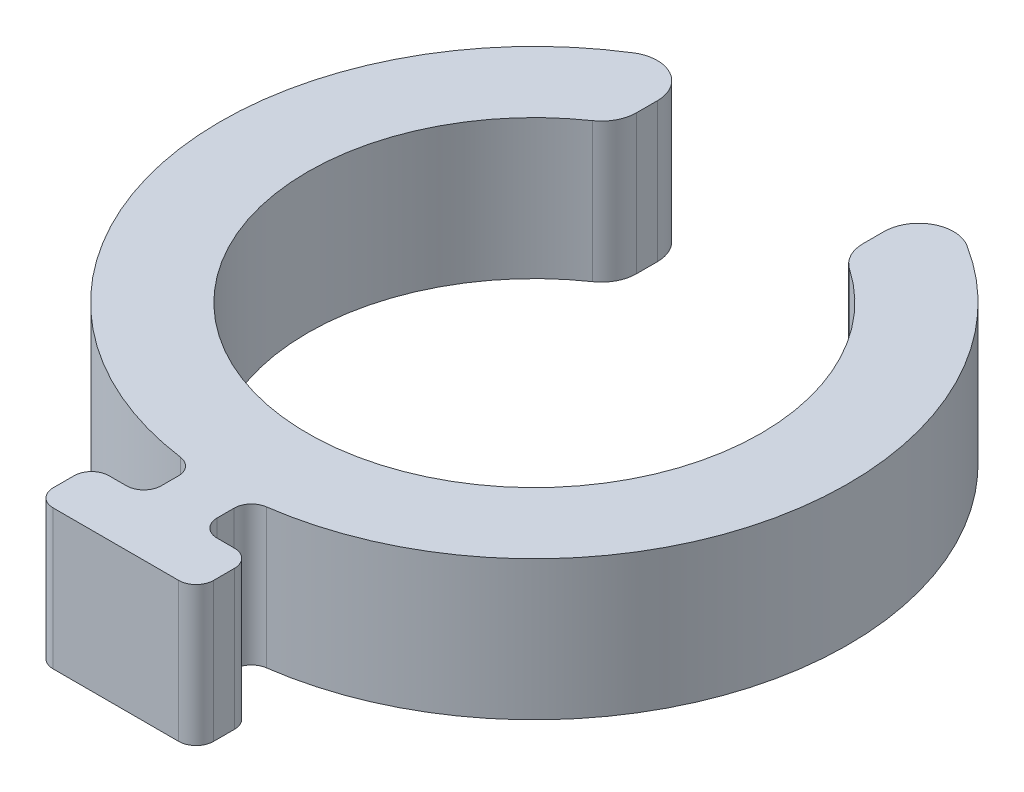
ISO-10303-21;
HEADER;
FILE_DESCRIPTION(('STEP AP214'),'2;1');
FILE_NAME('part.step','',(''),(''),'','','');
FILE_SCHEMA(('AUTOMOTIVE_DESIGN { 1 0 10303 214 1 1 1 1 }'));
ENDSEC;
DATA;
#1=APPLICATION_CONTEXT('core data for automotive mechanical design processes');
#2=APPLICATION_PROTOCOL_DEFINITION('international standard','automotive_design',2000,#1);
#3=PRODUCT_CONTEXT('',#1,'mechanical');
#4=PRODUCT('Part','Part','',(#3));
#5=PRODUCT_RELATED_PRODUCT_CATEGORY('part','',(#4));
#6=PRODUCT_DEFINITION_FORMATION('','',#4);
#7=PRODUCT_DEFINITION_CONTEXT('part definition',#1,'design');
#8=PRODUCT_DEFINITION('design','',#6,#7);
#9=PRODUCT_DEFINITION_SHAPE('','',#8);
#10=(LENGTH_UNIT() NAMED_UNIT(*) SI_UNIT(.MILLI.,.METRE.));
#11=(NAMED_UNIT(*) PLANE_ANGLE_UNIT() SI_UNIT($,.RADIAN.));
#12=(NAMED_UNIT(*) SI_UNIT($,.STERADIAN.) SOLID_ANGLE_UNIT());
#13=UNCERTAINTY_MEASURE_WITH_UNIT(LENGTH_MEASURE(1.E-05),#10,'distance_accuracy_value','');
#14=(GEOMETRIC_REPRESENTATION_CONTEXT(3) GLOBAL_UNCERTAINTY_ASSIGNED_CONTEXT((#13)) GLOBAL_UNIT_ASSIGNED_CONTEXT((#10,
#11,#12)) REPRESENTATION_CONTEXT('',''));
#15=CARTESIAN_POINT('',(0.,0.,0.));
#16=DIRECTION('',(0.,0.,1.));
#17=DIRECTION('',(1.,0.,0.));
#18=AXIS2_PLACEMENT_3D('',#15,#16,#17);
#19=CARTESIAN_POINT('',(0.,4.,0.));
#20=DIRECTION('',(0.,-1.,0.));
#21=DIRECTION('',(0.,0.,-1.));
#22=AXIS2_PLACEMENT_3D('',#19,#20,#21);
#23=CYLINDRICAL_SURFACE('',#22,9.);
#24=CARTESIAN_POINT('',(0.,0.,0.));
#25=DIRECTION('',(0.,1.,0.));
#26=DIRECTION('',(0.,0.,1.));
#27=AXIS2_PLACEMENT_3D('',#24,#25,#26);
#28=CIRCLE('',#27,9.);
#29=CARTESIAN_POINT('',(-4.78125,0.,-7.62493596284585));
#30=VERTEX_POINT('',#29);
#31=CARTESIAN_POINT('',(-1.23157894736842,0.,8.91533584877198));
#32=VERTEX_POINT('',#31);
#33=EDGE_CURVE('E326',#30,#32,#28,.T.);
#34=ORIENTED_EDGE('',*,*,#33,.T.);
#35=DIRECTION('',(0.,-1.,0.));
#36=VECTOR('',#35,1.);
#37=CARTESIAN_POINT('',(-1.23157894736842,4.,8.91533584877199));
#38=LINE('',#37,#36);
#39=CARTESIAN_POINT('',(-1.23157894736842,4.,8.91533584877198));
#40=VERTEX_POINT('',#39);
#41=EDGE_CURVE('E288',#32,#40,#38,.F.);
#42=ORIENTED_EDGE('',*,*,#41,.T.);
#43=CARTESIAN_POINT('',(0.,4.,0.));
#44=DIRECTION('',(0.,1.,0.));
#45=DIRECTION('',(0.,0.,1.));
#46=AXIS2_PLACEMENT_3D('',#43,#44,#45);
#47=CIRCLE('',#46,9.);
#48=CARTESIAN_POINT('',(-4.78125,4.,-7.62493596284585));
#49=VERTEX_POINT('',#48);
#50=EDGE_CURVE('E205',#49,#40,#47,.T.);
#51=ORIENTED_EDGE('',*,*,#50,.F.);
#52=DIRECTION('',(0.,-1.,0.));
#53=VECTOR('',#52,1.);
#54=CARTESIAN_POINT('',(-4.78125,4.,-7.62493596284585));
#55=LINE('',#54,#53);
#56=EDGE_CURVE('E230',#49,#30,#55,.T.);
#57=ORIENTED_EDGE('',*,*,#56,.T.);
#58=EDGE_LOOP('',(#34,#42,#51,#57));
#59=FACE_BOUND('',#58,.T.);
#60=ADVANCED_FACE('F16',(#59),#23,.T.);
#61=CARTESIAN_POINT('',(1.23157894736842,4.,8.91533584877198));
#62=VERTEX_POINT('',#61);
#63=CARTESIAN_POINT('',(4.78125,4.,-7.62493596284585));
#64=VERTEX_POINT('',#63);
#65=EDGE_CURVE('E202',#62,#64,#47,.T.);
#66=ORIENTED_EDGE('',*,*,#65,.F.);
#67=DIRECTION('',(0.,-1.,0.));
#68=VECTOR('',#67,1.);
#69=CARTESIAN_POINT('',(1.23157894736842,4.,8.91533584877199));
#70=LINE('',#69,#68);
#71=CARTESIAN_POINT('',(1.23157894736842,0.,8.91533584877198));
#72=VERTEX_POINT('',#71);
#73=EDGE_CURVE('E290',#62,#72,#70,.T.);
#74=ORIENTED_EDGE('',*,*,#73,.T.);
#75=CARTESIAN_POINT('',(4.78125,0.,-7.62493596284585));
#76=VERTEX_POINT('',#75);
#77=EDGE_CURVE('E208',#72,#76,#28,.T.);
#78=ORIENTED_EDGE('',*,*,#77,.T.);
#79=DIRECTION('',(0.,-1.,0.));
#80=VECTOR('',#79,1.);
#81=CARTESIAN_POINT('',(4.78125,4.,-7.62493596284585));
#82=LINE('',#81,#80);
#83=EDGE_CURVE('E227',#76,#64,#82,.F.);
#84=ORIENTED_EDGE('',*,*,#83,.T.);
#85=EDGE_LOOP('',(#66,#74,#78,#84));
#86=FACE_BOUND('',#85,.T.);
#87=ADVANCED_FACE('F420',(#86),#23,.T.);
#88=CARTESIAN_POINT('',(0.,4.,0.));
#89=DIRECTION('',(0.,1.,0.));
#90=DIRECTION('',(0.,0.,1.));
#91=AXIS2_PLACEMENT_3D('',#88,#89,#90);
#92=PLANE('',#91);
#93=DIRECTION('',(-1.,0.,0.));
#94=VECTOR('',#93,1.);
#95=CARTESIAN_POINT('',(-2.3,4.,10.4));
#96=LINE('',#95,#94);
#97=CARTESIAN_POINT('',(-1.3,4.,10.4));
#98=VERTEX_POINT('',#97);
#99=CARTESIAN_POINT('',(-1.8,4.,10.4));
#100=VERTEX_POINT('',#99);
#101=EDGE_CURVE('E320',#98,#100,#96,.T.);
#102=ORIENTED_EDGE('',*,*,#101,.T.);
#103=CARTESIAN_POINT('',(-1.8,4.,10.9));
#104=DIRECTION('',(0.,1.,0.));
#105=DIRECTION('',(0.,0.,1.));
#106=AXIS2_PLACEMENT_3D('',#103,#104,#105);
#107=CIRCLE('',#106,0.5);
#108=CARTESIAN_POINT('',(-2.3,4.,10.9));
#109=VERTEX_POINT('',#108);
#110=EDGE_CURVE('E261',#100,#109,#107,.T.);
#111=ORIENTED_EDGE('',*,*,#110,.T.);
#112=DIRECTION('',(0.,0.,1.));
#113=VECTOR('',#112,1.);
#114=CARTESIAN_POINT('',(-2.3,4.,12.));
#115=LINE('',#114,#113);
#116=CARTESIAN_POINT('',(-2.3,4.,11.5));
#117=VERTEX_POINT('',#116);
#118=EDGE_CURVE('E343',#109,#117,#115,.T.);
#119=ORIENTED_EDGE('',*,*,#118,.T.);
#120=CARTESIAN_POINT('',(-1.8,4.,11.5));
#121=DIRECTION('',(0.,1.,0.));
#122=DIRECTION('',(0.,0.,1.));
#123=AXIS2_PLACEMENT_3D('',#120,#121,#122);
#124=CIRCLE('',#123,0.5);
#125=CARTESIAN_POINT('',(-1.8,4.,12.));
#126=VERTEX_POINT('',#125);
#127=EDGE_CURVE('E259',#117,#126,#124,.T.);
#128=ORIENTED_EDGE('',*,*,#127,.T.);
#129=DIRECTION('',(1.,0.,0.));
#130=VECTOR('',#129,1.);
#131=CARTESIAN_POINT('',(-2.3,4.,12.));
#132=LINE('',#131,#130);
#133=CARTESIAN_POINT('',(1.8,4.,12.));
#134=VERTEX_POINT('',#133);
#135=EDGE_CURVE('E336',#126,#134,#132,.T.);
#136=ORIENTED_EDGE('',*,*,#135,.T.);
#137=CARTESIAN_POINT('',(1.8,4.,11.5));
#138=DIRECTION('',(0.,1.,0.));
#139=DIRECTION('',(0.,0.,1.));
#140=AXIS2_PLACEMENT_3D('',#137,#138,#139);
#141=CIRCLE('',#140,0.5);
#142=CARTESIAN_POINT('',(2.3,4.,11.5));
#143=VERTEX_POINT('',#142);
#144=EDGE_CURVE('E255',#134,#143,#141,.T.);
#145=ORIENTED_EDGE('',*,*,#144,.T.);
#146=DIRECTION('',(0.,0.,-1.));
#147=VECTOR('',#146,1.);
#148=CARTESIAN_POINT('',(2.3,4.,12.));
#149=LINE('',#148,#147);
#150=CARTESIAN_POINT('',(2.3,4.,10.9));
#151=VERTEX_POINT('',#150);
#152=EDGE_CURVE('E331',#143,#151,#149,.T.);
#153=ORIENTED_EDGE('',*,*,#152,.T.);
#154=CARTESIAN_POINT('',(1.8,4.,10.9));
#155=DIRECTION('',(0.,1.,0.));
#156=DIRECTION('',(0.,0.,1.));
#157=AXIS2_PLACEMENT_3D('',#154,#155,#156);
#158=CIRCLE('',#157,0.5);
#159=CARTESIAN_POINT('',(1.8,4.,10.4));
#160=VERTEX_POINT('',#159);
#161=EDGE_CURVE('E257',#151,#160,#158,.T.);
#162=ORIENTED_EDGE('',*,*,#161,.T.);
#163=DIRECTION('',(-1.,0.,0.));
#164=VECTOR('',#163,1.);
#165=CARTESIAN_POINT('',(0.8,4.,10.4));
#166=LINE('',#165,#164);
#167=CARTESIAN_POINT('',(1.3,4.,10.4));
#168=VERTEX_POINT('',#167);
#169=EDGE_CURVE('E329',#160,#168,#166,.T.);
#170=ORIENTED_EDGE('',*,*,#169,.T.);
#171=CARTESIAN_POINT('',(1.3,4.,9.9));
#172=DIRECTION('',(0.,1.,0.));
#173=DIRECTION('',(0.,0.,1.));
#174=AXIS2_PLACEMENT_3D('',#171,#172,#173);
#175=CIRCLE('',#174,0.5);
#176=CARTESIAN_POINT('',(0.8,4.,9.9));
#177=VERTEX_POINT('',#176);
#178=EDGE_CURVE('E294',#168,#177,#175,.F.);
#179=ORIENTED_EDGE('',*,*,#178,.T.);
#180=DIRECTION('',(0.,0.,-1.));
#181=VECTOR('',#180,1.);
#182=CARTESIAN_POINT('',(0.8,4.,10.4));
#183=LINE('',#182,#181);
#184=CARTESIAN_POINT('',(0.8,4.,9.41063228481487));
#185=VERTEX_POINT('',#184);
#186=EDGE_CURVE('E321',#177,#185,#183,.T.);
#187=ORIENTED_EDGE('',*,*,#186,.T.);
#188=CARTESIAN_POINT('',(1.3,4.,9.41063228481487));
#189=DIRECTION('',(0.,1.,0.));
#190=DIRECTION('',(0.,0.,1.));
#191=AXIS2_PLACEMENT_3D('',#188,#189,#190);
#192=CIRCLE('',#191,0.5);
#193=EDGE_CURVE('E24',#185,#62,#192,.F.);
#194=ORIENTED_EDGE('',*,*,#193,.T.);
#195=ORIENTED_EDGE('',*,*,#65,.T.);
#196=CARTESIAN_POINT('',(4.25,4.,-6.77772085586298));
#197=DIRECTION('',(0.,1.,0.));
#198=DIRECTION('',(0.,0.,1.));
#199=AXIS2_PLACEMENT_3D('',#196,#197,#198);
#200=CIRCLE('',#199,1.);
#201=CARTESIAN_POINT('',(3.25,4.,-6.77772085586298));
#202=VERTEX_POINT('',#201);
#203=EDGE_CURVE('E223',#64,#202,#200,.T.);
#204=ORIENTED_EDGE('',*,*,#203,.T.);
#205=DIRECTION('',(0.,0.,-1.));
#206=VECTOR('',#205,1.);
#207=CARTESIAN_POINT('',(3.25,4.,0.));
#208=LINE('',#207,#206);
#209=CARTESIAN_POINT('',(3.25,4.,-6.17960354715414));
#210=VERTEX_POINT('',#209);
#211=EDGE_CURVE('E432',#210,#202,#208,.T.);
#212=ORIENTED_EDGE('',*,*,#211,.F.);
#213=CARTESIAN_POINT('',(4.25,4.,-6.17960354715414));
#214=DIRECTION('',(0.,1.,0.));
#215=DIRECTION('',(0.,0.,1.));
#216=AXIS2_PLACEMENT_3D('',#213,#214,#215);
#217=CIRCLE('',#216,1.);
#218=CARTESIAN_POINT('',(3.68333333333333,4.,-5.35565640753359));
#219=VERTEX_POINT('',#218);
#220=EDGE_CURVE('E225',#210,#219,#217,.T.);
#221=ORIENTED_EDGE('',*,*,#220,.T.);
#222=CARTESIAN_POINT('',(0.,4.,0.));
#223=DIRECTION('',(0.,1.,0.));
#224=DIRECTION('',(0.,0.,1.));
#225=AXIS2_PLACEMENT_3D('',#222,#223,#224);
#226=CIRCLE('',#225,6.5);
#227=CARTESIAN_POINT('',(-3.68333333333333,4.,-5.35565640753359));
#228=VERTEX_POINT('',#227);
#229=EDGE_CURVE('E198',#228,#219,#226,.T.);
#230=ORIENTED_EDGE('',*,*,#229,.F.);
#231=CARTESIAN_POINT('',(-4.25,4.,-6.17960354715414));
#232=DIRECTION('',(0.,1.,0.));
#233=DIRECTION('',(0.,0.,1.));
#234=AXIS2_PLACEMENT_3D('',#231,#232,#233);
#235=CIRCLE('',#234,1.);
#236=CARTESIAN_POINT('',(-3.25,4.,-6.17960354715414));
#237=VERTEX_POINT('',#236);
#238=EDGE_CURVE('E201',#228,#237,#235,.T.);
#239=ORIENTED_EDGE('',*,*,#238,.T.);
#240=DIRECTION('',(0.,0.,1.));
#241=VECTOR('',#240,1.);
#242=CARTESIAN_POINT('',(-3.25,4.,0.));
#243=LINE('',#242,#241);
#244=CARTESIAN_POINT('',(-3.25,4.,-6.77772085586298));
#245=VERTEX_POINT('',#244);
#246=EDGE_CURVE('E436',#245,#237,#243,.T.);
#247=ORIENTED_EDGE('',*,*,#246,.F.);
#248=CARTESIAN_POINT('',(-4.25,4.,-6.77772085586298));
#249=DIRECTION('',(0.,1.,0.));
#250=DIRECTION('',(0.,0.,1.));
#251=AXIS2_PLACEMENT_3D('',#248,#249,#250);
#252=CIRCLE('',#251,1.);
#253=EDGE_CURVE('E221',#245,#49,#252,.T.);
#254=ORIENTED_EDGE('',*,*,#253,.T.);
#255=ORIENTED_EDGE('',*,*,#50,.T.);
#256=CARTESIAN_POINT('',(-1.3,4.,9.41063228481487));
#257=DIRECTION('',(0.,1.,0.));
#258=DIRECTION('',(0.,0.,1.));
#259=AXIS2_PLACEMENT_3D('',#256,#257,#258);
#260=CIRCLE('',#259,0.5);
#261=CARTESIAN_POINT('',(-0.8,4.,9.41063228481487));
#262=VERTEX_POINT('',#261);
#263=EDGE_CURVE('E302',#40,#262,#260,.F.);
#264=ORIENTED_EDGE('',*,*,#263,.T.);
#265=DIRECTION('',(0.,0.,1.));
#266=VECTOR('',#265,1.);
#267=CARTESIAN_POINT('',(-0.8,4.,10.4));
#268=LINE('',#267,#266);
#269=CARTESIAN_POINT('',(-0.8,4.,9.9));
#270=VERTEX_POINT('',#269);
#271=EDGE_CURVE('E309',#262,#270,#268,.T.);
#272=ORIENTED_EDGE('',*,*,#271,.T.);
#273=CARTESIAN_POINT('',(-1.3,4.,9.9));
#274=DIRECTION('',(0.,1.,0.));
#275=DIRECTION('',(0.,0.,1.));
#276=AXIS2_PLACEMENT_3D('',#273,#274,#275);
#277=CIRCLE('',#276,0.5);
#278=EDGE_CURVE('E298',#270,#98,#277,.F.);
#279=ORIENTED_EDGE('',*,*,#278,.T.);
#280=EDGE_LOOP('',(#102,#111,#119,#128,#136,#145,#153,#162,#170,#179,#187,#194,#195,#204,#212,
#221,#230,#239,#247,#254,#255,#264,#272,#279));
#281=FACE_BOUND('',#280,.T.);
#282=ADVANCED_FACE('F308',(#281),#92,.T.);
#283=CARTESIAN_POINT('',(0.,0.,0.));
#284=DIRECTION('',(0.,1.,0.));
#285=DIRECTION('',(0.,0.,1.));
#286=AXIS2_PLACEMENT_3D('',#283,#284,#285);
#287=PLANE('',#286);
#288=DIRECTION('',(0.,0.,1.));
#289=VECTOR('',#288,1.);
#290=CARTESIAN_POINT('',(-2.3,0.,12.));
#291=LINE('',#290,#289);
#292=CARTESIAN_POINT('',(-2.3,0.,10.9));
#293=VERTEX_POINT('',#292);
#294=CARTESIAN_POINT('',(-2.3,0.,11.5));
#295=VERTEX_POINT('',#294);
#296=EDGE_CURVE('E364',#293,#295,#291,.T.);
#297=ORIENTED_EDGE('',*,*,#296,.F.);
#298=CARTESIAN_POINT('',(-1.8,0.,10.9));
#299=DIRECTION('',(0.,1.,0.));
#300=DIRECTION('',(0.,0.,1.));
#301=AXIS2_PLACEMENT_3D('',#298,#299,#300);
#302=CIRCLE('',#301,0.5);
#303=CARTESIAN_POINT('',(-1.8,0.,10.4));
#304=VERTEX_POINT('',#303);
#305=EDGE_CURVE('E248',#293,#304,#302,.F.);
#306=ORIENTED_EDGE('',*,*,#305,.T.);
#307=DIRECTION('',(-1.,0.,0.));
#308=VECTOR('',#307,1.);
#309=CARTESIAN_POINT('',(-2.3,0.,10.4));
#310=LINE('',#309,#308);
#311=CARTESIAN_POINT('',(-1.3,0.,10.4));
#312=VERTEX_POINT('',#311);
#313=EDGE_CURVE('E366',#312,#304,#310,.T.);
#314=ORIENTED_EDGE('',*,*,#313,.F.);
#315=CARTESIAN_POINT('',(-1.3,0.,9.9));
#316=DIRECTION('',(0.,1.,0.));
#317=DIRECTION('',(0.,0.,1.));
#318=AXIS2_PLACEMENT_3D('',#315,#316,#317);
#319=CIRCLE('',#318,0.5);
#320=CARTESIAN_POINT('',(-0.8,0.,9.9));
#321=VERTEX_POINT('',#320);
#322=EDGE_CURVE('E296',#312,#321,#319,.T.);
#323=ORIENTED_EDGE('',*,*,#322,.T.);
#324=DIRECTION('',(0.,0.,1.));
#325=VECTOR('',#324,1.);
#326=CARTESIAN_POINT('',(-0.8,0.,10.4));
#327=LINE('',#326,#325);
#328=CARTESIAN_POINT('',(-0.8,0.,9.41063228481487));
#329=VERTEX_POINT('',#328);
#330=EDGE_CURVE('E197',#329,#321,#327,.T.);
#331=ORIENTED_EDGE('',*,*,#330,.F.);
#332=CARTESIAN_POINT('',(-1.3,0.,9.41063228481487));
#333=DIRECTION('',(0.,1.,0.));
#334=DIRECTION('',(0.,0.,1.));
#335=AXIS2_PLACEMENT_3D('',#332,#333,#334);
#336=CIRCLE('',#335,0.5);
#337=EDGE_CURVE('E300',#329,#32,#336,.T.);
#338=ORIENTED_EDGE('',*,*,#337,.T.);
#339=ORIENTED_EDGE('',*,*,#33,.F.);
#340=CARTESIAN_POINT('',(-4.25,0.,-6.77772085586298));
#341=DIRECTION('',(0.,1.,0.));
#342=DIRECTION('',(0.,0.,1.));
#343=AXIS2_PLACEMENT_3D('',#340,#341,#342);
#344=CIRCLE('',#343,1.);
#345=CARTESIAN_POINT('',(-3.25,0.,-6.77772085586298));
#346=VERTEX_POINT('',#345);
#347=EDGE_CURVE('E186',#30,#346,#344,.F.);
#348=ORIENTED_EDGE('',*,*,#347,.T.);
#349=DIRECTION('',(0.,0.,1.));
#350=VECTOR('',#349,1.);
#351=CARTESIAN_POINT('',(-3.25,0.,0.));
#352=LINE('',#351,#350);
#353=CARTESIAN_POINT('',(-3.25,0.,-6.17960354715414));
#354=VERTEX_POINT('',#353);
#355=EDGE_CURVE('E182',#346,#354,#352,.T.);
#356=ORIENTED_EDGE('',*,*,#355,.T.);
#357=CARTESIAN_POINT('',(-4.25,0.,-6.17960354715414));
#358=DIRECTION('',(0.,1.,0.));
#359=DIRECTION('',(0.,0.,1.));
#360=AXIS2_PLACEMENT_3D('',#357,#358,#359);
#361=CIRCLE('',#360,1.);
#362=CARTESIAN_POINT('',(-3.68333333333333,0.,-5.35565640753359));
#363=VERTEX_POINT('',#362);
#364=EDGE_CURVE('E176',#354,#363,#361,.F.);
#365=ORIENTED_EDGE('',*,*,#364,.T.);
#366=CARTESIAN_POINT('',(0.,0.,0.));
#367=DIRECTION('',(0.,1.,0.));
#368=DIRECTION('',(0.,0.,1.));
#369=AXIS2_PLACEMENT_3D('',#366,#367,#368);
#370=CIRCLE('',#369,6.5);
#371=CARTESIAN_POINT('',(3.68333333333333,0.,-5.35565640753359));
#372=VERTEX_POINT('',#371);
#373=EDGE_CURVE('E180',#363,#372,#370,.T.);
#374=ORIENTED_EDGE('',*,*,#373,.T.);
#375=CARTESIAN_POINT('',(4.25,0.,-6.17960354715414));
#376=DIRECTION('',(0.,1.,0.));
#377=DIRECTION('',(0.,0.,1.));
#378=AXIS2_PLACEMENT_3D('',#375,#376,#377);
#379=CIRCLE('',#378,1.);
#380=CARTESIAN_POINT('',(3.25,0.,-6.17960354715414));
#381=VERTEX_POINT('',#380);
#382=EDGE_CURVE('E214',#372,#381,#379,.F.);
#383=ORIENTED_EDGE('',*,*,#382,.T.);
#384=DIRECTION('',(0.,0.,-1.));
#385=VECTOR('',#384,1.);
#386=CARTESIAN_POINT('',(3.25,0.,0.));
#387=LINE('',#386,#385);
#388=CARTESIAN_POINT('',(3.25,0.,-6.77772085586298));
#389=VERTEX_POINT('',#388);
#390=EDGE_CURVE('E430',#381,#389,#387,.T.);
#391=ORIENTED_EDGE('',*,*,#390,.T.);
#392=CARTESIAN_POINT('',(4.25,0.,-6.77772085586298));
#393=DIRECTION('',(0.,1.,0.));
#394=DIRECTION('',(0.,0.,1.));
#395=AXIS2_PLACEMENT_3D('',#392,#393,#394);
#396=CIRCLE('',#395,1.);
#397=EDGE_CURVE('E211',#389,#76,#396,.F.);
#398=ORIENTED_EDGE('',*,*,#397,.T.);
#399=ORIENTED_EDGE('',*,*,#77,.F.);
#400=CARTESIAN_POINT('',(1.3,0.,9.41063228481487));
#401=DIRECTION('',(0.,1.,0.));
#402=DIRECTION('',(0.,0.,1.));
#403=AXIS2_PLACEMENT_3D('',#400,#401,#402);
#404=CIRCLE('',#403,0.5);
#405=CARTESIAN_POINT('',(0.8,0.,9.41063228481487));
#406=VERTEX_POINT('',#405);
#407=EDGE_CURVE('E11',#72,#406,#404,.T.);
#408=ORIENTED_EDGE('',*,*,#407,.T.);
#409=DIRECTION('',(0.,0.,-1.));
#410=VECTOR('',#409,1.);
#411=CARTESIAN_POINT('',(0.8,0.,10.4));
#412=LINE('',#411,#410);
#413=CARTESIAN_POINT('',(0.8,0.,9.9));
#414=VERTEX_POINT('',#413);
#415=EDGE_CURVE('E347',#414,#406,#412,.T.);
#416=ORIENTED_EDGE('',*,*,#415,.F.);
#417=CARTESIAN_POINT('',(1.3,0.,9.9));
#418=DIRECTION('',(0.,1.,0.));
#419=DIRECTION('',(0.,0.,1.));
#420=AXIS2_PLACEMENT_3D('',#417,#418,#419);
#421=CIRCLE('',#420,0.5);
#422=CARTESIAN_POINT('',(1.3,0.,10.4));
#423=VERTEX_POINT('',#422);
#424=EDGE_CURVE('E292',#414,#423,#421,.T.);
#425=ORIENTED_EDGE('',*,*,#424,.T.);
#426=DIRECTION('',(-1.,0.,0.));
#427=VECTOR('',#426,1.);
#428=CARTESIAN_POINT('',(0.8,0.,10.4));
#429=LINE('',#428,#427);
#430=CARTESIAN_POINT('',(1.8,0.,10.4));
#431=VERTEX_POINT('',#430);
#432=EDGE_CURVE('E350',#431,#423,#429,.T.);
#433=ORIENTED_EDGE('',*,*,#432,.F.);
#434=CARTESIAN_POINT('',(1.8,0.,10.9));
#435=DIRECTION('',(0.,1.,0.));
#436=DIRECTION('',(0.,0.,1.));
#437=AXIS2_PLACEMENT_3D('',#434,#435,#436);
#438=CIRCLE('',#437,0.5);
#439=CARTESIAN_POINT('',(2.3,0.,10.9));
#440=VERTEX_POINT('',#439);
#441=EDGE_CURVE('E244',#431,#440,#438,.F.);
#442=ORIENTED_EDGE('',*,*,#441,.T.);
#443=DIRECTION('',(0.,0.,-1.));
#444=VECTOR('',#443,1.);
#445=CARTESIAN_POINT('',(2.3,0.,12.));
#446=LINE('',#445,#444);
#447=CARTESIAN_POINT('',(2.3,0.,11.5));
#448=VERTEX_POINT('',#447);
#449=EDGE_CURVE('E355',#448,#440,#446,.T.);
#450=ORIENTED_EDGE('',*,*,#449,.F.);
#451=CARTESIAN_POINT('',(1.8,0.,11.5));
#452=DIRECTION('',(0.,1.,0.));
#453=DIRECTION('',(0.,0.,1.));
#454=AXIS2_PLACEMENT_3D('',#451,#452,#453);
#455=CIRCLE('',#454,0.5);
#456=CARTESIAN_POINT('',(1.8,0.,12.));
#457=VERTEX_POINT('',#456);
#458=EDGE_CURVE('E242',#448,#457,#455,.F.);
#459=ORIENTED_EDGE('',*,*,#458,.T.);
#460=DIRECTION('',(1.,0.,0.));
#461=VECTOR('',#460,1.);
#462=CARTESIAN_POINT('',(-2.3,0.,12.));
#463=LINE('',#462,#461);
#464=CARTESIAN_POINT('',(-1.8,0.,12.));
#465=VERTEX_POINT('',#464);
#466=EDGE_CURVE('E361',#465,#457,#463,.T.);
#467=ORIENTED_EDGE('',*,*,#466,.F.);
#468=CARTESIAN_POINT('',(-1.8,0.,11.5));
#469=DIRECTION('',(0.,1.,0.));
#470=DIRECTION('',(0.,0.,1.));
#471=AXIS2_PLACEMENT_3D('',#468,#469,#470);
#472=CIRCLE('',#471,0.5);
#473=EDGE_CURVE('E246',#465,#295,#472,.F.);
#474=ORIENTED_EDGE('',*,*,#473,.T.);
#475=EDGE_LOOP('',(#297,#306,#314,#323,#331,#338,#339,#348,#356,#365,#374,#383,#391,#398,#399,
#408,#416,#425,#433,#442,#450,#459,#467,#474));
#476=FACE_BOUND('',#475,.T.);
#477=ADVANCED_FACE('F179',(#476),#287,.F.);
#478=CARTESIAN_POINT('',(-0.8,16.8514590611339,10.4));
#479=DIRECTION('',(1.,0.,0.));
#480=DIRECTION('',(0.,0.,-1.));
#481=AXIS2_PLACEMENT_3D('',#478,#479,#480);
#482=PLANE('',#481);
#483=ORIENTED_EDGE('',*,*,#330,.T.);
#484=DIRECTION('',(0.,-1.,0.));
#485=VECTOR('',#484,1.);
#486=CARTESIAN_POINT('',(-0.8,4.,9.9));
#487=LINE('',#486,#485);
#488=EDGE_CURVE('E286',#321,#270,#487,.F.);
#489=ORIENTED_EDGE('',*,*,#488,.T.);
#490=ORIENTED_EDGE('',*,*,#271,.F.);
#491=DIRECTION('',(0.,1.,0.));
#492=VECTOR('',#491,1.);
#493=CARTESIAN_POINT('',(-0.8,0.,9.41063228481487));
#494=LINE('',#493,#492);
#495=EDGE_CURVE('E283',#262,#329,#494,.F.);
#496=ORIENTED_EDGE('',*,*,#495,.T.);
#497=EDGE_LOOP('',(#483,#489,#490,#496));
#498=FACE_BOUND('',#497,.T.);
#499=ADVANCED_FACE('F317',(#498),#482,.F.);
#500=CARTESIAN_POINT('',(0.8,16.8514590611339,10.4));
#501=DIRECTION('',(-1.,0.,0.));
#502=DIRECTION('',(0.,0.,1.));
#503=AXIS2_PLACEMENT_3D('',#500,#501,#502);
#504=PLANE('',#503);
#505=ORIENTED_EDGE('',*,*,#186,.F.);
#506=DIRECTION('',(0.,-1.,0.));
#507=VECTOR('',#506,1.);
#508=CARTESIAN_POINT('',(0.8,0.,9.9));
#509=LINE('',#508,#507);
#510=EDGE_CURVE('E280',#177,#414,#509,.T.);
#511=ORIENTED_EDGE('',*,*,#510,.T.);
#512=ORIENTED_EDGE('',*,*,#415,.T.);
#513=DIRECTION('',(0.,1.,0.));
#514=VECTOR('',#513,1.);
#515=CARTESIAN_POINT('',(0.8,4.,9.41063228481487));
#516=LINE('',#515,#514);
#517=EDGE_CURVE('E278',#406,#185,#516,.T.);
#518=ORIENTED_EDGE('',*,*,#517,.T.);
#519=EDGE_LOOP('',(#505,#511,#512,#518));
#520=FACE_BOUND('',#519,.T.);
#521=ADVANCED_FACE('F413',(#520),#504,.F.);
#522=CARTESIAN_POINT('',(-2.3,16.8514590611339,10.4));
#523=DIRECTION('',(0.,0.,1.));
#524=DIRECTION('',(1.,0.,0.));
#525=AXIS2_PLACEMENT_3D('',#522,#523,#524);
#526=PLANE('',#525);
#527=ORIENTED_EDGE('',*,*,#313,.T.);
#528=DIRECTION('',(0.,-1.,0.));
#529=VECTOR('',#528,1.);
#530=CARTESIAN_POINT('',(-1.8,16.8514590611339,10.4));
#531=LINE('',#530,#529);
#532=EDGE_CURVE('E253',#304,#100,#531,.F.);
#533=ORIENTED_EDGE('',*,*,#532,.T.);
#534=ORIENTED_EDGE('',*,*,#101,.F.);
#535=DIRECTION('',(0.,-1.,0.));
#536=VECTOR('',#535,1.);
#537=CARTESIAN_POINT('',(-1.3,0.,10.4));
#538=LINE('',#537,#536);
#539=EDGE_CURVE('E250',#98,#312,#538,.T.);
#540=ORIENTED_EDGE('',*,*,#539,.T.);
#541=EDGE_LOOP('',(#527,#533,#534,#540));
#542=FACE_BOUND('',#541,.T.);
#543=ADVANCED_FACE('F376',(#542),#526,.F.);
#544=CARTESIAN_POINT('',(-2.3,16.8514590611339,12.));
#545=DIRECTION('',(1.,0.,0.));
#546=DIRECTION('',(0.,0.,-1.));
#547=AXIS2_PLACEMENT_3D('',#544,#545,#546);
#548=PLANE('',#547);
#549=ORIENTED_EDGE('',*,*,#118,.F.);
#550=DIRECTION('',(0.,-1.,0.));
#551=VECTOR('',#550,1.);
#552=CARTESIAN_POINT('',(-2.3,16.8514590611339,10.9));
#553=LINE('',#552,#551);
#554=EDGE_CURVE('E239',#109,#293,#553,.T.);
#555=ORIENTED_EDGE('',*,*,#554,.T.);
#556=ORIENTED_EDGE('',*,*,#296,.T.);
#557=DIRECTION('',(0.,-1.,0.));
#558=VECTOR('',#557,1.);
#559=CARTESIAN_POINT('',(-2.3,16.8514590611339,11.5));
#560=LINE('',#559,#558);
#561=EDGE_CURVE('E237',#295,#117,#560,.F.);
#562=ORIENTED_EDGE('',*,*,#561,.T.);
#563=EDGE_LOOP('',(#549,#555,#556,#562));
#564=FACE_BOUND('',#563,.T.);
#565=ADVANCED_FACE('F383',(#564),#548,.F.);
#566=CARTESIAN_POINT('',(-2.3,16.8514590611339,12.));
#567=DIRECTION('',(0.,0.,-1.));
#568=DIRECTION('',(-1.,0.,0.));
#569=AXIS2_PLACEMENT_3D('',#566,#567,#568);
#570=PLANE('',#569);
#571=ORIENTED_EDGE('',*,*,#135,.F.);
#572=DIRECTION('',(0.,-1.,0.));
#573=VECTOR('',#572,1.);
#574=CARTESIAN_POINT('',(-1.8,16.8514590611339,12.));
#575=LINE('',#574,#573);
#576=EDGE_CURVE('E265',#126,#465,#575,.T.);
#577=ORIENTED_EDGE('',*,*,#576,.T.);
#578=ORIENTED_EDGE('',*,*,#466,.T.);
#579=DIRECTION('',(0.,-1.,0.));
#580=VECTOR('',#579,1.);
#581=CARTESIAN_POINT('',(1.8,16.8514590611339,12.));
#582=LINE('',#581,#580);
#583=EDGE_CURVE('E263',#457,#134,#582,.F.);
#584=ORIENTED_EDGE('',*,*,#583,.T.);
#585=EDGE_LOOP('',(#571,#577,#578,#584));
#586=FACE_BOUND('',#585,.T.);
#587=ADVANCED_FACE('F391',(#586),#570,.F.);
#588=CARTESIAN_POINT('',(2.3,16.8514590611339,12.));
#589=DIRECTION('',(-1.,0.,0.));
#590=DIRECTION('',(0.,0.,1.));
#591=AXIS2_PLACEMENT_3D('',#588,#589,#590);
#592=PLANE('',#591);
#593=ORIENTED_EDGE('',*,*,#449,.T.);
#594=DIRECTION('',(0.,-1.,0.));
#595=VECTOR('',#594,1.);
#596=CARTESIAN_POINT('',(2.3,16.8514590611339,10.9));
#597=LINE('',#596,#595);
#598=EDGE_CURVE('E276',#440,#151,#597,.F.);
#599=ORIENTED_EDGE('',*,*,#598,.T.);
#600=ORIENTED_EDGE('',*,*,#152,.F.);
#601=DIRECTION('',(0.,-1.,0.));
#602=VECTOR('',#601,1.);
#603=CARTESIAN_POINT('',(2.3,16.8514590611339,11.5));
#604=LINE('',#603,#602);
#605=EDGE_CURVE('E273',#143,#448,#604,.T.);
#606=ORIENTED_EDGE('',*,*,#605,.T.);
#607=EDGE_LOOP('',(#593,#599,#600,#606));
#608=FACE_BOUND('',#607,.T.);
#609=ADVANCED_FACE('F400',(#608),#592,.F.);
#610=CARTESIAN_POINT('',(0.8,16.8514590611339,10.4));
#611=DIRECTION('',(0.,0.,1.));
#612=DIRECTION('',(1.,0.,0.));
#613=AXIS2_PLACEMENT_3D('',#610,#611,#612);
#614=PLANE('',#613);
#615=ORIENTED_EDGE('',*,*,#169,.F.);
#616=DIRECTION('',(0.,-1.,0.));
#617=VECTOR('',#616,1.);
#618=CARTESIAN_POINT('',(1.8,16.8514590611339,10.4));
#619=LINE('',#618,#617);
#620=EDGE_CURVE('E270',#160,#431,#619,.T.);
#621=ORIENTED_EDGE('',*,*,#620,.T.);
#622=ORIENTED_EDGE('',*,*,#432,.T.);
#623=DIRECTION('',(0.,-1.,0.));
#624=VECTOR('',#623,1.);
#625=CARTESIAN_POINT('',(1.3,4.,10.4));
#626=LINE('',#625,#624);
#627=EDGE_CURVE('E268',#423,#168,#626,.F.);
#628=ORIENTED_EDGE('',*,*,#627,.T.);
#629=EDGE_LOOP('',(#615,#621,#622,#628));
#630=FACE_BOUND('',#629,.T.);
#631=ADVANCED_FACE('F407',(#630),#614,.F.);
#632=CARTESIAN_POINT('',(0.,0.,0.));
#633=DIRECTION('',(0.,1.,0.));
#634=DIRECTION('',(0.,0.,1.));
#635=AXIS2_PLACEMENT_3D('',#632,#633,#634);
#636=CYLINDRICAL_SURFACE('',#635,6.5);
#637=ORIENTED_EDGE('',*,*,#229,.T.);
#638=DIRECTION('',(0.,1.,0.));
#639=VECTOR('',#638,1.);
#640=CARTESIAN_POINT('',(3.68333333333333,0.,-5.35565640753359));
#641=LINE('',#640,#639);
#642=EDGE_CURVE('E187',#219,#372,#641,.F.);
#643=ORIENTED_EDGE('',*,*,#642,.T.);
#644=ORIENTED_EDGE('',*,*,#373,.F.);
#645=DIRECTION('',(0.,1.,0.));
#646=VECTOR('',#645,1.);
#647=CARTESIAN_POINT('',(-3.68333333333333,0.,-5.35565640753359));
#648=LINE('',#647,#646);
#649=EDGE_CURVE('E194',#363,#228,#648,.T.);
#650=ORIENTED_EDGE('',*,*,#649,.T.);
#651=EDGE_LOOP('',(#637,#643,#644,#650));
#652=FACE_BOUND('',#651,.T.);
#653=ADVANCED_FACE('F193',(#652),#636,.F.);
#654=CARTESIAN_POINT('',(3.25,0.,0.));
#655=DIRECTION('',(1.,0.,0.));
#656=DIRECTION('',(0.,0.,-1.));
#657=AXIS2_PLACEMENT_3D('',#654,#655,#656);
#658=PLANE('',#657);
#659=ORIENTED_EDGE('',*,*,#390,.F.);
#660=DIRECTION('',(0.,1.,0.));
#661=VECTOR('',#660,1.);
#662=CARTESIAN_POINT('',(3.25,0.,-6.17960354715414));
#663=LINE('',#662,#661);
#664=EDGE_CURVE('E218',#381,#210,#663,.T.);
#665=ORIENTED_EDGE('',*,*,#664,.T.);
#666=ORIENTED_EDGE('',*,*,#211,.T.);
#667=DIRECTION('',(0.,-1.,0.));
#668=VECTOR('',#667,1.);
#669=CARTESIAN_POINT('',(3.25,0.,-6.77772085586298));
#670=LINE('',#669,#668);
#671=EDGE_CURVE('E216',#202,#389,#670,.T.);
#672=ORIENTED_EDGE('',*,*,#671,.T.);
#673=EDGE_LOOP('',(#659,#665,#666,#672));
#674=FACE_BOUND('',#673,.T.);
#675=ADVANCED_FACE('F429',(#674),#658,.F.);
#676=CARTESIAN_POINT('',(-3.25,0.,0.));
#677=DIRECTION('',(-1.,0.,0.));
#678=DIRECTION('',(0.,0.,1.));
#679=AXIS2_PLACEMENT_3D('',#676,#677,#678);
#680=PLANE('',#679);
#681=ORIENTED_EDGE('',*,*,#355,.F.);
#682=DIRECTION('',(0.,-1.,0.));
#683=VECTOR('',#682,1.);
#684=CARTESIAN_POINT('',(-3.25,0.,-6.77772085586298));
#685=LINE('',#684,#683);
#686=EDGE_CURVE('E235',#346,#245,#685,.F.);
#687=ORIENTED_EDGE('',*,*,#686,.T.);
#688=ORIENTED_EDGE('',*,*,#246,.T.);
#689=DIRECTION('',(0.,1.,0.));
#690=VECTOR('',#689,1.);
#691=CARTESIAN_POINT('',(-3.25,0.,-6.17960354715414));
#692=LINE('',#691,#690);
#693=EDGE_CURVE('E233',#237,#354,#692,.F.);
#694=ORIENTED_EDGE('',*,*,#693,.T.);
#695=EDGE_LOOP('',(#681,#687,#688,#694));
#696=FACE_BOUND('',#695,.T.);
#697=ADVANCED_FACE('F441',(#696),#680,.F.);
#698=CARTESIAN_POINT('',(4.25,0.,-6.17960354715414));
#699=DIRECTION('',(0.,1.,0.));
#700=DIRECTION('',(0.,0.,1.));
#701=AXIS2_PLACEMENT_3D('',#698,#699,#700);
#702=CYLINDRICAL_SURFACE('',#701,1.);
#703=ORIENTED_EDGE('',*,*,#220,.F.);
#704=ORIENTED_EDGE('',*,*,#664,.F.);
#705=ORIENTED_EDGE('',*,*,#382,.F.);
#706=ORIENTED_EDGE('',*,*,#642,.F.);
#707=EDGE_LOOP('',(#703,#704,#705,#706));
#708=FACE_BOUND('',#707,.T.);
#709=ADVANCED_FACE('F454',(#708),#702,.T.);
#710=CARTESIAN_POINT('',(4.25,4.,-6.77772085586298));
#711=DIRECTION('',(0.,-1.,0.));
#712=DIRECTION('',(0.,0.,-1.));
#713=AXIS2_PLACEMENT_3D('',#710,#711,#712);
#714=CYLINDRICAL_SURFACE('',#713,1.);
#715=ORIENTED_EDGE('',*,*,#397,.F.);
#716=ORIENTED_EDGE('',*,*,#671,.F.);
#717=ORIENTED_EDGE('',*,*,#203,.F.);
#718=ORIENTED_EDGE('',*,*,#83,.F.);
#719=EDGE_LOOP('',(#715,#716,#717,#718));
#720=FACE_BOUND('',#719,.T.);
#721=ADVANCED_FACE('F426',(#720),#714,.T.);
#722=CARTESIAN_POINT('',(-4.25,4.,-6.77772085586298));
#723=DIRECTION('',(0.,-1.,0.));
#724=DIRECTION('',(0.,0.,-1.));
#725=AXIS2_PLACEMENT_3D('',#722,#723,#724);
#726=CYLINDRICAL_SURFACE('',#725,1.);
#727=ORIENTED_EDGE('',*,*,#253,.F.);
#728=ORIENTED_EDGE('',*,*,#686,.F.);
#729=ORIENTED_EDGE('',*,*,#347,.F.);
#730=ORIENTED_EDGE('',*,*,#56,.F.);
#731=EDGE_LOOP('',(#727,#728,#729,#730));
#732=FACE_BOUND('',#731,.T.);
#733=ADVANCED_FACE('F445',(#732),#726,.T.);
#734=CARTESIAN_POINT('',(-4.25,0.,-6.17960354715414));
#735=DIRECTION('',(0.,1.,0.));
#736=DIRECTION('',(0.,0.,1.));
#737=AXIS2_PLACEMENT_3D('',#734,#735,#736);
#738=CYLINDRICAL_SURFACE('',#737,1.);
#739=ORIENTED_EDGE('',*,*,#364,.F.);
#740=ORIENTED_EDGE('',*,*,#693,.F.);
#741=ORIENTED_EDGE('',*,*,#238,.F.);
#742=ORIENTED_EDGE('',*,*,#649,.F.);
#743=EDGE_LOOP('',(#739,#740,#741,#742));
#744=FACE_BOUND('',#743,.T.);
#745=ADVANCED_FACE('F200',(#744),#738,.T.);
#746=CARTESIAN_POINT('',(-1.8,16.8514590611339,10.9));
#747=DIRECTION('',(0.,-1.,0.));
#748=DIRECTION('',(0.,0.,-1.));
#749=AXIS2_PLACEMENT_3D('',#746,#747,#748);
#750=CYLINDRICAL_SURFACE('',#749,0.5);
#751=ORIENTED_EDGE('',*,*,#110,.F.);
#752=ORIENTED_EDGE('',*,*,#532,.F.);
#753=ORIENTED_EDGE('',*,*,#305,.F.);
#754=ORIENTED_EDGE('',*,*,#554,.F.);
#755=EDGE_LOOP('',(#751,#752,#753,#754));
#756=FACE_BOUND('',#755,.T.);
#757=ADVANCED_FACE('F378',(#756),#750,.T.);
#758=CARTESIAN_POINT('',(-1.8,16.8514590611339,11.5));
#759=DIRECTION('',(0.,-1.,0.));
#760=DIRECTION('',(0.,0.,-1.));
#761=AXIS2_PLACEMENT_3D('',#758,#759,#760);
#762=CYLINDRICAL_SURFACE('',#761,0.5);
#763=ORIENTED_EDGE('',*,*,#127,.F.);
#764=ORIENTED_EDGE('',*,*,#561,.F.);
#765=ORIENTED_EDGE('',*,*,#473,.F.);
#766=ORIENTED_EDGE('',*,*,#576,.F.);
#767=EDGE_LOOP('',(#763,#764,#765,#766));
#768=FACE_BOUND('',#767,.T.);
#769=ADVANCED_FACE('F386',(#768),#762,.T.);
#770=CARTESIAN_POINT('',(1.8,16.8514590611339,10.9));
#771=DIRECTION('',(0.,-1.,0.));
#772=DIRECTION('',(0.,0.,-1.));
#773=AXIS2_PLACEMENT_3D('',#770,#771,#772);
#774=CYLINDRICAL_SURFACE('',#773,0.5);
#775=ORIENTED_EDGE('',*,*,#161,.F.);
#776=ORIENTED_EDGE('',*,*,#598,.F.);
#777=ORIENTED_EDGE('',*,*,#441,.F.);
#778=ORIENTED_EDGE('',*,*,#620,.F.);
#779=EDGE_LOOP('',(#775,#776,#777,#778));
#780=FACE_BOUND('',#779,.T.);
#781=ADVANCED_FACE('F404',(#780),#774,.T.);
#782=CARTESIAN_POINT('',(1.8,16.8514590611339,11.5));
#783=DIRECTION('',(0.,-1.,0.));
#784=DIRECTION('',(0.,0.,-1.));
#785=AXIS2_PLACEMENT_3D('',#782,#783,#784);
#786=CYLINDRICAL_SURFACE('',#785,0.5);
#787=ORIENTED_EDGE('',*,*,#144,.F.);
#788=ORIENTED_EDGE('',*,*,#583,.F.);
#789=ORIENTED_EDGE('',*,*,#458,.F.);
#790=ORIENTED_EDGE('',*,*,#605,.F.);
#791=EDGE_LOOP('',(#787,#788,#789,#790));
#792=FACE_BOUND('',#791,.T.);
#793=ADVANCED_FACE('F395',(#792),#786,.T.);
#794=CARTESIAN_POINT('',(1.3,16.8514590611339,9.9));
#795=DIRECTION('',(0.,1.,0.));
#796=DIRECTION('',(0.,0.,1.));
#797=AXIS2_PLACEMENT_3D('',#794,#795,#796);
#798=CYLINDRICAL_SURFACE('',#797,0.5);
#799=ORIENTED_EDGE('',*,*,#178,.F.);
#800=ORIENTED_EDGE('',*,*,#627,.F.);
#801=ORIENTED_EDGE('',*,*,#424,.F.);
#802=ORIENTED_EDGE('',*,*,#510,.F.);
#803=EDGE_LOOP('',(#799,#800,#801,#802));
#804=FACE_BOUND('',#803,.T.);
#805=ADVANCED_FACE('F411',(#804),#798,.F.);
#806=CARTESIAN_POINT('',(-1.3,16.8514590611339,9.9));
#807=DIRECTION('',(0.,1.,0.));
#808=DIRECTION('',(0.,0.,1.));
#809=AXIS2_PLACEMENT_3D('',#806,#807,#808);
#810=CYLINDRICAL_SURFACE('',#809,0.5);
#811=ORIENTED_EDGE('',*,*,#278,.F.);
#812=ORIENTED_EDGE('',*,*,#488,.F.);
#813=ORIENTED_EDGE('',*,*,#322,.F.);
#814=ORIENTED_EDGE('',*,*,#539,.F.);
#815=EDGE_LOOP('',(#811,#812,#813,#814));
#816=FACE_BOUND('',#815,.T.);
#817=ADVANCED_FACE('F372',(#816),#810,.F.);
#818=CARTESIAN_POINT('',(-1.3,4.,9.41063228481487));
#819=DIRECTION('',(0.,-1.,0.));
#820=DIRECTION('',(0.,0.,-1.));
#821=AXIS2_PLACEMENT_3D('',#818,#819,#820);
#822=CYLINDRICAL_SURFACE('',#821,0.5);
#823=ORIENTED_EDGE('',*,*,#263,.F.);
#824=ORIENTED_EDGE('',*,*,#41,.F.);
#825=ORIENTED_EDGE('',*,*,#337,.F.);
#826=ORIENTED_EDGE('',*,*,#495,.F.);
#827=EDGE_LOOP('',(#823,#824,#825,#826));
#828=FACE_BOUND('',#827,.T.);
#829=ADVANCED_FACE('F323',(#828),#822,.F.);
#830=CARTESIAN_POINT('',(1.3,4.,9.41063228481487));
#831=DIRECTION('',(0.,-1.,0.));
#832=DIRECTION('',(0.,0.,-1.));
#833=AXIS2_PLACEMENT_3D('',#830,#831,#832);
#834=CYLINDRICAL_SURFACE('',#833,0.5);
#835=ORIENTED_EDGE('',*,*,#407,.F.);
#836=ORIENTED_EDGE('',*,*,#73,.F.);
#837=ORIENTED_EDGE('',*,*,#193,.F.);
#838=ORIENTED_EDGE('',*,*,#517,.F.);
#839=EDGE_LOOP('',(#835,#836,#837,#838));
#840=FACE_BOUND('',#839,.T.);
#841=ADVANCED_FACE('F18',(#840),#834,.F.);
#842=CLOSED_SHELL('',(#60,#87,#282,#477,#499,#521,#543,#565,#587,#609,#631,#653,#675,#697,#709,
#721,#733,#745,#757,#769,#781,#793,#805,#817,#829,#841));
#843=MANIFOLD_SOLID_BREP('B1',#842);
#844=ADVANCED_BREP_SHAPE_REPRESENTATION('',(#18,#843),#14);
#845=SHAPE_DEFINITION_REPRESENTATION(#9,#844);
ENDSEC;
END-ISO-10303-21;
